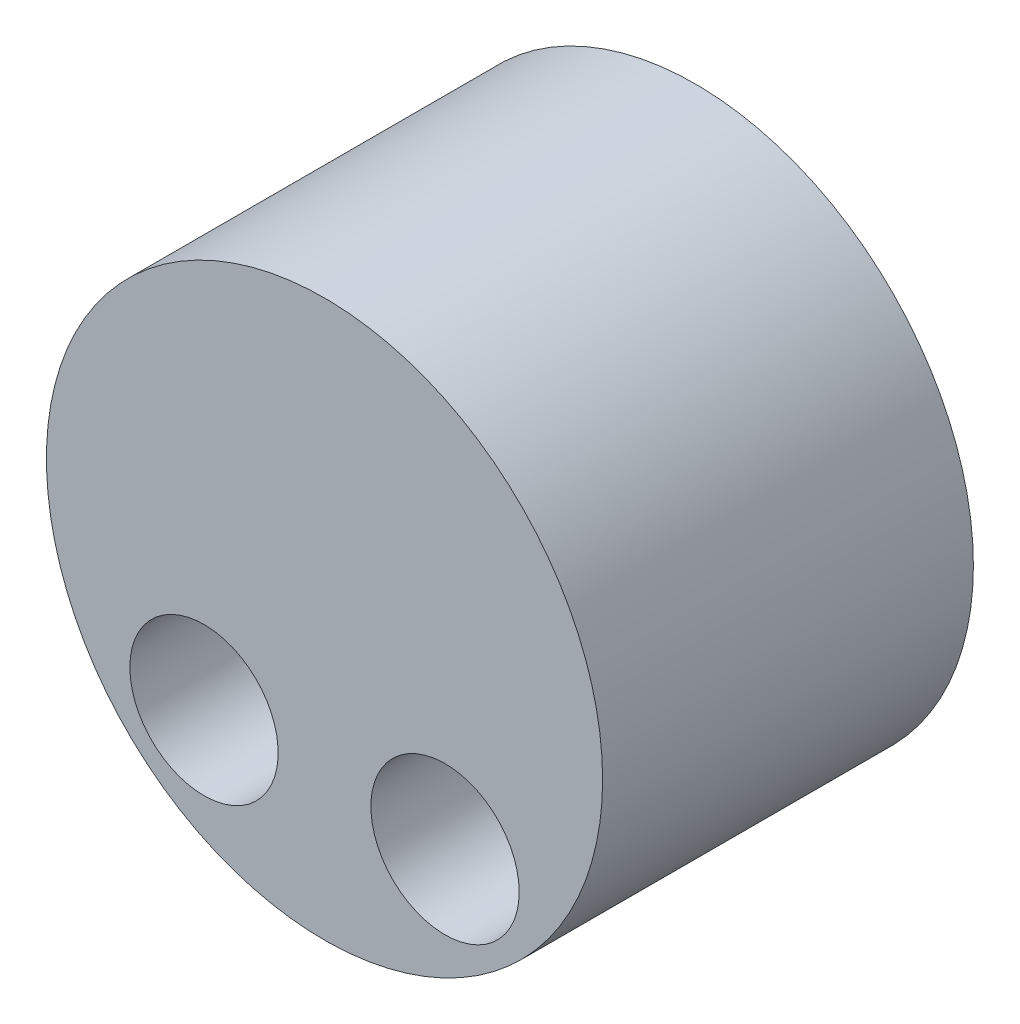
ISO-10303-21;
HEADER;
FILE_DESCRIPTION(('STEP AP214'),'2;1');
FILE_NAME('part.step','',(''),(''),'','','');
FILE_SCHEMA(('AUTOMOTIVE_DESIGN { 1 0 10303 214 1 1 1 1 }'));
ENDSEC;
DATA;
#1=APPLICATION_CONTEXT('core data for automotive mechanical design processes');
#2=APPLICATION_PROTOCOL_DEFINITION('international standard','automotive_design',2000,#1);
#3=PRODUCT_CONTEXT('',#1,'mechanical');
#4=PRODUCT('Part','Part','',(#3));
#5=PRODUCT_RELATED_PRODUCT_CATEGORY('part','',(#4));
#6=PRODUCT_DEFINITION_FORMATION('','',#4);
#7=PRODUCT_DEFINITION_CONTEXT('part definition',#1,'design');
#8=PRODUCT_DEFINITION('design','',#6,#7);
#9=PRODUCT_DEFINITION_SHAPE('','',#8);
#10=(LENGTH_UNIT() NAMED_UNIT(*) SI_UNIT(.MILLI.,.METRE.));
#11=(NAMED_UNIT(*) PLANE_ANGLE_UNIT() SI_UNIT($,.RADIAN.));
#12=(NAMED_UNIT(*) SI_UNIT($,.STERADIAN.) SOLID_ANGLE_UNIT());
#13=UNCERTAINTY_MEASURE_WITH_UNIT(LENGTH_MEASURE(1.E-05),#10,'distance_accuracy_value','');
#14=(GEOMETRIC_REPRESENTATION_CONTEXT(3) GLOBAL_UNCERTAINTY_ASSIGNED_CONTEXT((#13)) GLOBAL_UNIT_ASSIGNED_CONTEXT((#10,
#11,#12)) REPRESENTATION_CONTEXT('',''));
#15=CARTESIAN_POINT('',(0.,0.,0.));
#16=DIRECTION('',(0.,0.,1.));
#17=DIRECTION('',(1.,0.,0.));
#18=AXIS2_PLACEMENT_3D('',#15,#16,#17);
#19=CARTESIAN_POINT('',(0.,0.,4.));
#20=DIRECTION('',(0.,0.,1.));
#21=DIRECTION('',(1.,0.,0.));
#22=AXIS2_PLACEMENT_3D('',#19,#20,#21);
#23=PLANE('',#22);
#24=CARTESIAN_POINT('',(1.3,-1.5,4.));
#25=DIRECTION('',(0.,0.,1.));
#26=DIRECTION('',(1.,0.,0.));
#27=AXIS2_PLACEMENT_3D('',#24,#25,#26);
#28=CIRCLE('',#27,0.800000000000001);
#29=CARTESIAN_POINT('',(2.1,-1.5,4.));
#30=VERTEX_POINT('',#29);
#31=EDGE_CURVE('E50',#30,#30,#28,.T.);
#32=ORIENTED_EDGE('',*,*,#31,.F.);
#33=EDGE_LOOP('',(#32));
#34=FACE_BOUND('',#33,.T.);
#35=CARTESIAN_POINT('',(0.,0.,4.));
#36=DIRECTION('',(0.,0.,1.));
#37=DIRECTION('',(1.,0.,0.));
#38=AXIS2_PLACEMENT_3D('',#35,#36,#37);
#39=CIRCLE('',#38,3.);
#40=CARTESIAN_POINT('',(3.,0.,4.));
#41=VERTEX_POINT('',#40);
#42=EDGE_CURVE('E10',#41,#41,#39,.T.);
#43=ORIENTED_EDGE('',*,*,#42,.T.);
#44=EDGE_LOOP('',(#43));
#45=FACE_BOUND('',#44,.T.);
#46=CARTESIAN_POINT('',(-1.3,-1.5,4.));
#47=DIRECTION('',(0.,0.,1.));
#48=DIRECTION('',(-1.,0.,0.));
#49=AXIS2_PLACEMENT_3D('',#46,#47,#48);
#50=CIRCLE('',#49,0.8);
#51=CARTESIAN_POINT('',(-2.1,-1.5,4.));
#52=VERTEX_POINT('',#51);
#53=EDGE_CURVE('E56',#52,#52,#50,.T.);
#54=ORIENTED_EDGE('',*,*,#53,.F.);
#55=EDGE_LOOP('',(#54));
#56=FACE_BOUND('',#55,.T.);
#57=ADVANCED_FACE('F37',(#34,#45,#56),#23,.T.);
#58=CARTESIAN_POINT('',(0.,0.,0.));
#59=DIRECTION('',(0.,0.,1.));
#60=DIRECTION('',(1.,0.,0.));
#61=AXIS2_PLACEMENT_3D('',#58,#59,#60);
#62=PLANE('',#61);
#63=CARTESIAN_POINT('',(0.,0.,0.));
#64=DIRECTION('',(0.,0.,1.));
#65=DIRECTION('',(1.,0.,0.));
#66=AXIS2_PLACEMENT_3D('',#63,#64,#65);
#67=CIRCLE('',#66,3.);
#68=CARTESIAN_POINT('',(3.,0.,0.));
#69=VERTEX_POINT('',#68);
#70=EDGE_CURVE('E41',#69,#69,#67,.T.);
#71=ORIENTED_EDGE('',*,*,#70,.F.);
#72=EDGE_LOOP('',(#71));
#73=FACE_BOUND('',#72,.T.);
#74=CARTESIAN_POINT('',(1.3,-1.5,0.));
#75=DIRECTION('',(0.,0.,1.));
#76=DIRECTION('',(1.,0.,0.));
#77=AXIS2_PLACEMENT_3D('',#74,#75,#76);
#78=CIRCLE('',#77,0.800000000000001);
#79=CARTESIAN_POINT('',(2.1,-1.5,0.));
#80=VERTEX_POINT('',#79);
#81=EDGE_CURVE('E52',#80,#80,#78,.T.);
#82=ORIENTED_EDGE('',*,*,#81,.T.);
#83=EDGE_LOOP('',(#82));
#84=FACE_BOUND('',#83,.T.);
#85=CARTESIAN_POINT('',(-1.3,-1.5,0.));
#86=DIRECTION('',(0.,0.,1.));
#87=DIRECTION('',(-1.,0.,0.));
#88=AXIS2_PLACEMENT_3D('',#85,#86,#87);
#89=CIRCLE('',#88,0.8);
#90=CARTESIAN_POINT('',(-2.1,-1.5,0.));
#91=VERTEX_POINT('',#90);
#92=EDGE_CURVE('E60',#91,#91,#89,.T.);
#93=ORIENTED_EDGE('',*,*,#92,.T.);
#94=EDGE_LOOP('',(#93));
#95=FACE_BOUND('',#94,.T.);
#96=ADVANCED_FACE('F72',(#73,#84,#95),#62,.F.);
#97=CARTESIAN_POINT('',(0.,0.,4.));
#98=DIRECTION('',(0.,0.,-1.));
#99=DIRECTION('',(-1.,0.,0.));
#100=AXIS2_PLACEMENT_3D('',#97,#98,#99);
#101=CYLINDRICAL_SURFACE('',#100,3.);
#102=ORIENTED_EDGE('',*,*,#42,.F.);
#103=EDGE_LOOP('',(#102));
#104=FACE_BOUND('',#103,.T.);
#105=ORIENTED_EDGE('',*,*,#70,.T.);
#106=EDGE_LOOP('',(#105));
#107=FACE_BOUND('',#106,.T.);
#108=ADVANCED_FACE('F39',(#104,#107),#101,.T.);
#109=CARTESIAN_POINT('',(1.3,-1.5,4.));
#110=DIRECTION('',(0.,0.,-1.));
#111=DIRECTION('',(-1.,0.,0.));
#112=AXIS2_PLACEMENT_3D('',#109,#110,#111);
#113=CYLINDRICAL_SURFACE('',#112,0.800000000000001);
#114=ORIENTED_EDGE('',*,*,#31,.T.);
#115=EDGE_LOOP('',(#114));
#116=FACE_BOUND('',#115,.T.);
#117=ORIENTED_EDGE('',*,*,#81,.F.);
#118=EDGE_LOOP('',(#117));
#119=FACE_BOUND('',#118,.T.);
#120=ADVANCED_FACE('F81',(#116,#119),#113,.F.);
#121=CARTESIAN_POINT('',(-1.3,-1.5,4.));
#122=DIRECTION('',(0.,0.,-1.));
#123=DIRECTION('',(-1.,0.,0.));
#124=AXIS2_PLACEMENT_3D('',#121,#122,#123);
#125=CYLINDRICAL_SURFACE('',#124,0.8);
#126=ORIENTED_EDGE('',*,*,#53,.T.);
#127=EDGE_LOOP('',(#126));
#128=FACE_BOUND('',#127,.T.);
#129=ORIENTED_EDGE('',*,*,#92,.F.);
#130=EDGE_LOOP('',(#129));
#131=FACE_BOUND('',#130,.T.);
#132=ADVANCED_FACE('F68',(#128,#131),#125,.F.);
#133=CLOSED_SHELL('',(#57,#96,#108,#120,#132));
#134=MANIFOLD_SOLID_BREP('B2',#133);
#135=ADVANCED_BREP_SHAPE_REPRESENTATION('',(#18,#134),#14);
#136=SHAPE_DEFINITION_REPRESENTATION(#9,#135);
ENDSEC;
END-ISO-10303-21;
